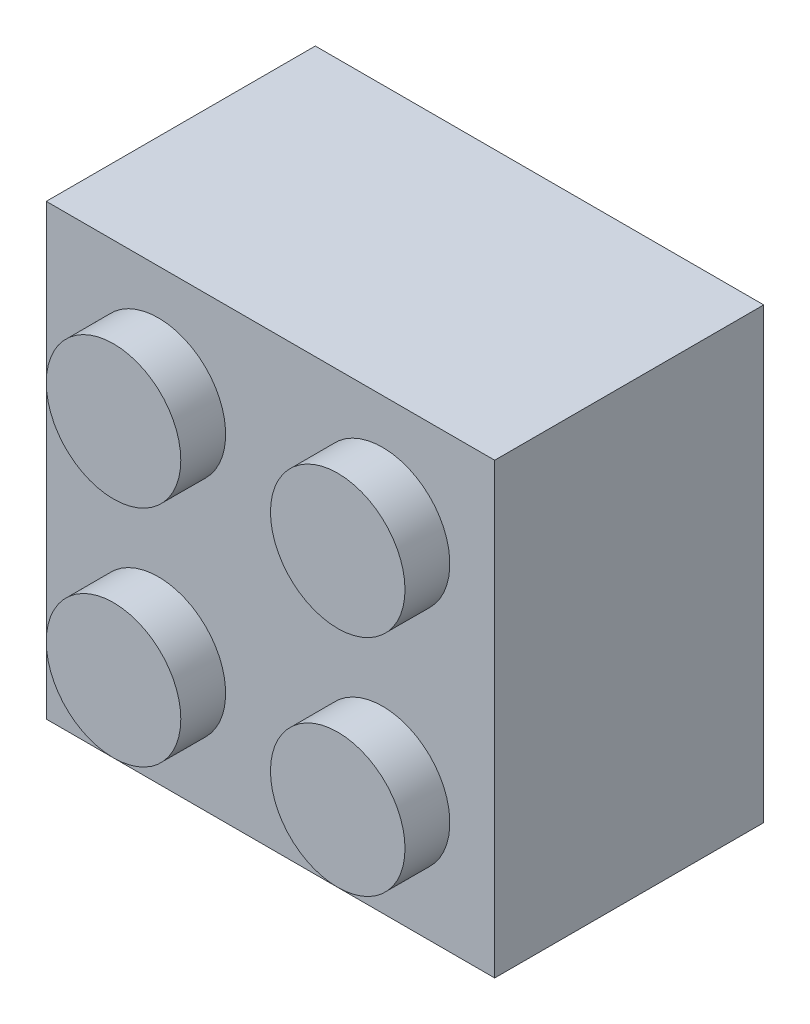
ISO-10303-21;
HEADER;
FILE_DESCRIPTION(('STEP AP214'),'2;1');
FILE_NAME('part.step','',(''),(''),'','','');
FILE_SCHEMA(('AUTOMOTIVE_DESIGN { 1 0 10303 214 1 1 1 1 }'));
ENDSEC;
DATA;
#1=APPLICATION_CONTEXT('core data for automotive mechanical design processes');
#2=APPLICATION_PROTOCOL_DEFINITION('international standard','automotive_design',2000,#1);
#3=PRODUCT_CONTEXT('',#1,'mechanical');
#4=PRODUCT('Part','Part','',(#3));
#5=PRODUCT_RELATED_PRODUCT_CATEGORY('part','',(#4));
#6=PRODUCT_DEFINITION_FORMATION('','',#4);
#7=PRODUCT_DEFINITION_CONTEXT('part definition',#1,'design');
#8=PRODUCT_DEFINITION('design','',#6,#7);
#9=PRODUCT_DEFINITION_SHAPE('','',#8);
#10=(LENGTH_UNIT() NAMED_UNIT(*) SI_UNIT(.MILLI.,.METRE.));
#11=(NAMED_UNIT(*) PLANE_ANGLE_UNIT() SI_UNIT($,.RADIAN.));
#12=(NAMED_UNIT(*) SI_UNIT($,.STERADIAN.) SOLID_ANGLE_UNIT());
#13=UNCERTAINTY_MEASURE_WITH_UNIT(LENGTH_MEASURE(1.E-05),#10,'distance_accuracy_value','');
#14=(GEOMETRIC_REPRESENTATION_CONTEXT(3) GLOBAL_UNCERTAINTY_ASSIGNED_CONTEXT((#13)) GLOBAL_UNIT_ASSIGNED_CONTEXT((#10,
#11,#12)) REPRESENTATION_CONTEXT('',''));
#15=CARTESIAN_POINT('',(0.,0.,0.));
#16=DIRECTION('',(0.,0.,1.));
#17=DIRECTION('',(1.,0.,0.));
#18=AXIS2_PLACEMENT_3D('',#15,#16,#17);
#19=CARTESIAN_POINT('',(0.,0.,7.9375));
#20=DIRECTION('',(0.,0.,-1.));
#21=DIRECTION('',(-1.,0.,0.));
#22=AXIS2_PLACEMENT_3D('',#19,#20,#21);
#23=PLANE('',#22);
#24=CARTESIAN_POINT('',(3.96875,11.90625,7.9375));
#25=DIRECTION('',(0.,0.,-1.));
#26=DIRECTION('',(-1.,0.,0.));
#27=AXIS2_PLACEMENT_3D('',#24,#25,#26);
#28=CIRCLE('',#27,0.79375);
#29=CARTESIAN_POINT('',(3.175,11.90625,7.9375));
#30=VERTEX_POINT('',#29);
#31=EDGE_CURVE('E139',#30,#30,#28,.F.);
#32=ORIENTED_EDGE('',*,*,#31,.T.);
#33=EDGE_LOOP('',(#32));
#34=FACE_BOUND('',#33,.T.);
#35=DIRECTION('',(0.,-1.,0.));
#36=VECTOR('',#35,1.);
#37=CARTESIAN_POINT('',(1.5875,0.,7.9375));
#38=LINE('',#37,#36);
#39=CARTESIAN_POINT('',(1.5875,14.2875,7.9375));
#40=VERTEX_POINT('',#39);
#41=CARTESIAN_POINT('',(1.5875,1.5875,7.9375));
#42=VERTEX_POINT('',#41);
#43=EDGE_CURVE('E121',#40,#42,#38,.T.);
#44=ORIENTED_EDGE('',*,*,#43,.F.);
#45=DIRECTION('',(-1.,0.,0.));
#46=VECTOR('',#45,1.);
#47=CARTESIAN_POINT('',(0.,14.2875,7.9375));
#48=LINE('',#47,#46);
#49=CARTESIAN_POINT('',(14.2875,14.2875,7.9375));
#50=VERTEX_POINT('',#49);
#51=EDGE_CURVE('E129',#50,#40,#48,.T.);
#52=ORIENTED_EDGE('',*,*,#51,.F.);
#53=DIRECTION('',(0.,1.,0.));
#54=VECTOR('',#53,1.);
#55=CARTESIAN_POINT('',(14.2875,0.,7.9375));
#56=LINE('',#55,#54);
#57=CARTESIAN_POINT('',(14.2875,1.5875,7.9375));
#58=VERTEX_POINT('',#57);
#59=EDGE_CURVE('E120',#58,#50,#56,.T.);
#60=ORIENTED_EDGE('',*,*,#59,.F.);
#61=DIRECTION('',(1.,0.,0.));
#62=VECTOR('',#61,1.);
#63=CARTESIAN_POINT('',(0.,1.5875,7.9375));
#64=LINE('',#63,#62);
#65=EDGE_CURVE('E110',#42,#58,#64,.T.);
#66=ORIENTED_EDGE('',*,*,#65,.F.);
#67=EDGE_LOOP('',(#44,#52,#60,#66));
#68=FACE_BOUND('',#67,.T.);
#69=CARTESIAN_POINT('',(3.96875,3.96875,7.9375));
#70=DIRECTION('',(0.,0.,-1.));
#71=DIRECTION('',(-1.,0.,0.));
#72=AXIS2_PLACEMENT_3D('',#69,#70,#71);
#73=CIRCLE('',#72,0.79375);
#74=CARTESIAN_POINT('',(3.175,3.96875,7.9375));
#75=VERTEX_POINT('',#74);
#76=EDGE_CURVE('E135',#75,#75,#73,.F.);
#77=ORIENTED_EDGE('',*,*,#76,.T.);
#78=EDGE_LOOP('',(#77));
#79=FACE_BOUND('',#78,.T.);
#80=CARTESIAN_POINT('',(11.90625,11.90625,7.9375));
#81=DIRECTION('',(0.,0.,-1.));
#82=DIRECTION('',(-1.,0.,0.));
#83=AXIS2_PLACEMENT_3D('',#80,#81,#82);
#84=CIRCLE('',#83,0.79375);
#85=CARTESIAN_POINT('',(11.1125,11.90625,7.9375));
#86=VERTEX_POINT('',#85);
#87=EDGE_CURVE('E138',#86,#86,#84,.F.);
#88=ORIENTED_EDGE('',*,*,#87,.T.);
#89=EDGE_LOOP('',(#88));
#90=FACE_BOUND('',#89,.T.);
#91=CARTESIAN_POINT('',(11.90625,3.96875,7.9375));
#92=DIRECTION('',(0.,0.,-1.));
#93=DIRECTION('',(-1.,0.,0.));
#94=AXIS2_PLACEMENT_3D('',#91,#92,#93);
#95=CIRCLE('',#94,0.79375);
#96=CARTESIAN_POINT('',(11.1125,3.96875,7.9375));
#97=VERTEX_POINT('',#96);
#98=EDGE_CURVE('E143',#97,#97,#95,.F.);
#99=ORIENTED_EDGE('',*,*,#98,.T.);
#100=EDGE_LOOP('',(#99));
#101=FACE_BOUND('',#100,.T.);
#102=CARTESIAN_POINT('',(7.9375,7.9375,7.9375));
#103=DIRECTION('',(0.,0.,-1.));
#104=DIRECTION('',(-1.,0.,0.));
#105=AXIS2_PLACEMENT_3D('',#102,#103,#104);
#106=CIRCLE('',#105,3.175);
#107=CARTESIAN_POINT('',(4.7625,7.9375,7.9375));
#108=VERTEX_POINT('',#107);
#109=EDGE_CURVE('E281',#108,#108,#106,.T.);
#110=ORIENTED_EDGE('',*,*,#109,.F.);
#111=EDGE_LOOP('',(#110));
#112=FACE_BOUND('',#111,.T.);
#113=ADVANCED_FACE('F35',(#34,#68,#79,#90,#101,#112),#23,.T.);
#114=CARTESIAN_POINT('',(0.,0.,0.));
#115=DIRECTION('',(0.,0.,-1.));
#116=DIRECTION('',(-1.,0.,0.));
#117=AXIS2_PLACEMENT_3D('',#114,#115,#116);
#118=PLANE('',#117);
#119=DIRECTION('',(0.,-1.,0.));
#120=VECTOR('',#119,1.);
#121=CARTESIAN_POINT('',(0.,0.,0.));
#122=LINE('',#121,#120);
#123=CARTESIAN_POINT('',(0.,15.875,0.));
#124=VERTEX_POINT('',#123);
#125=CARTESIAN_POINT('',(0.,0.,0.));
#126=VERTEX_POINT('',#125);
#127=EDGE_CURVE('E176',#124,#126,#122,.T.);
#128=ORIENTED_EDGE('',*,*,#127,.F.);
#129=DIRECTION('',(-1.,0.,0.));
#130=VECTOR('',#129,1.);
#131=CARTESIAN_POINT('',(0.,15.875,0.));
#132=LINE('',#131,#130);
#133=CARTESIAN_POINT('',(15.875,15.875,0.));
#134=VERTEX_POINT('',#133);
#135=EDGE_CURVE('E80',#134,#124,#132,.T.);
#136=ORIENTED_EDGE('',*,*,#135,.F.);
#137=DIRECTION('',(0.,1.,0.));
#138=VECTOR('',#137,1.);
#139=CARTESIAN_POINT('',(15.875,0.,0.));
#140=LINE('',#139,#138);
#141=CARTESIAN_POINT('',(15.875,0.,0.));
#142=VERTEX_POINT('',#141);
#143=EDGE_CURVE('E188',#142,#134,#140,.T.);
#144=ORIENTED_EDGE('',*,*,#143,.F.);
#145=DIRECTION('',(1.,0.,0.));
#146=VECTOR('',#145,1.);
#147=CARTESIAN_POINT('',(0.,0.,0.));
#148=LINE('',#147,#146);
#149=EDGE_CURVE('E186',#126,#142,#148,.T.);
#150=ORIENTED_EDGE('',*,*,#149,.F.);
#151=EDGE_LOOP('',(#128,#136,#144,#150));
#152=FACE_BOUND('',#151,.T.);
#153=DIRECTION('',(-1.,0.,0.));
#154=VECTOR('',#153,1.);
#155=CARTESIAN_POINT('',(0.,14.2875,0.));
#156=LINE('',#155,#154);
#157=CARTESIAN_POINT('',(14.2875,14.2875,0.));
#158=VERTEX_POINT('',#157);
#159=CARTESIAN_POINT('',(1.5875,14.2875,0.));
#160=VERTEX_POINT('',#159);
#161=EDGE_CURVE('E166',#158,#160,#156,.T.);
#162=ORIENTED_EDGE('',*,*,#161,.T.);
#163=DIRECTION('',(0.,-1.,0.));
#164=VECTOR('',#163,1.);
#165=CARTESIAN_POINT('',(1.5875,0.,0.));
#166=LINE('',#165,#164);
#167=CARTESIAN_POINT('',(1.5875,1.5875,0.));
#168=VERTEX_POINT('',#167);
#169=EDGE_CURVE('E153',#160,#168,#166,.T.);
#170=ORIENTED_EDGE('',*,*,#169,.T.);
#171=DIRECTION('',(1.,0.,0.));
#172=VECTOR('',#171,1.);
#173=CARTESIAN_POINT('',(0.,1.5875,0.));
#174=LINE('',#173,#172);
#175=CARTESIAN_POINT('',(14.2875,1.5875,0.));
#176=VERTEX_POINT('',#175);
#177=EDGE_CURVE('E165',#168,#176,#174,.T.);
#178=ORIENTED_EDGE('',*,*,#177,.T.);
#179=DIRECTION('',(0.,1.,0.));
#180=VECTOR('',#179,1.);
#181=CARTESIAN_POINT('',(14.2875,0.,0.));
#182=LINE('',#181,#180);
#183=EDGE_CURVE('E50',#176,#158,#182,.T.);
#184=ORIENTED_EDGE('',*,*,#183,.T.);
#185=EDGE_LOOP('',(#162,#170,#178,#184));
#186=FACE_BOUND('',#185,.T.);
#187=ADVANCED_FACE('F226',(#152,#186),#118,.T.);
#188=CARTESIAN_POINT('',(0.,0.,9.525));
#189=DIRECTION('',(0.,0.,-1.));
#190=DIRECTION('',(-1.,0.,0.));
#191=AXIS2_PLACEMENT_3D('',#188,#189,#190);
#192=PLANE('',#191);
#193=CARTESIAN_POINT('',(3.96875,11.90625,9.525));
#194=DIRECTION('',(0.,0.,-1.));
#195=DIRECTION('',(-1.,0.,0.));
#196=AXIS2_PLACEMENT_3D('',#193,#194,#195);
#197=CIRCLE('',#196,2.38125);
#198=CARTESIAN_POINT('',(1.5875,11.90625,9.525));
#199=VERTEX_POINT('',#198);
#200=EDGE_CURVE('E199',#199,#199,#197,.F.);
#201=ORIENTED_EDGE('',*,*,#200,.F.);
#202=EDGE_LOOP('',(#201));
#203=FACE_BOUND('',#202,.T.);
#204=DIRECTION('',(0.,-1.,0.));
#205=VECTOR('',#204,1.);
#206=CARTESIAN_POINT('',(0.,0.,9.525));
#207=LINE('',#206,#205);
#208=CARTESIAN_POINT('',(0.,15.875,9.525));
#209=VERTEX_POINT('',#208);
#210=CARTESIAN_POINT('',(0.,0.,9.525));
#211=VERTEX_POINT('',#210);
#212=EDGE_CURVE('E177',#209,#211,#207,.T.);
#213=ORIENTED_EDGE('',*,*,#212,.T.);
#214=DIRECTION('',(1.,0.,0.));
#215=VECTOR('',#214,1.);
#216=CARTESIAN_POINT('',(0.,0.,9.525));
#217=LINE('',#216,#215);
#218=CARTESIAN_POINT('',(15.875,0.,9.525));
#219=VERTEX_POINT('',#218);
#220=EDGE_CURVE('E88',#211,#219,#217,.T.);
#221=ORIENTED_EDGE('',*,*,#220,.T.);
#222=DIRECTION('',(0.,1.,0.));
#223=VECTOR('',#222,1.);
#224=CARTESIAN_POINT('',(15.875,0.,9.525));
#225=LINE('',#224,#223);
#226=CARTESIAN_POINT('',(15.875,15.875,9.525));
#227=VERTEX_POINT('',#226);
#228=EDGE_CURVE('E180',#219,#227,#225,.T.);
#229=ORIENTED_EDGE('',*,*,#228,.T.);
#230=DIRECTION('',(-1.,0.,0.));
#231=VECTOR('',#230,1.);
#232=CARTESIAN_POINT('',(0.,15.875,9.525));
#233=LINE('',#232,#231);
#234=EDGE_CURVE('E59',#227,#209,#233,.T.);
#235=ORIENTED_EDGE('',*,*,#234,.T.);
#236=EDGE_LOOP('',(#213,#221,#229,#235));
#237=FACE_BOUND('',#236,.T.);
#238=CARTESIAN_POINT('',(3.96875,3.96875,9.525));
#239=DIRECTION('',(0.,0.,-1.));
#240=DIRECTION('',(-1.,0.,0.));
#241=AXIS2_PLACEMENT_3D('',#238,#239,#240);
#242=CIRCLE('',#241,2.38125);
#243=CARTESIAN_POINT('',(1.5875,3.96875,9.525));
#244=VERTEX_POINT('',#243);
#245=EDGE_CURVE('E202',#244,#244,#242,.F.);
#246=ORIENTED_EDGE('',*,*,#245,.F.);
#247=EDGE_LOOP('',(#246));
#248=FACE_BOUND('',#247,.T.);
#249=CARTESIAN_POINT('',(11.90625,11.90625,9.525));
#250=DIRECTION('',(0.,0.,-1.));
#251=DIRECTION('',(-1.,0.,0.));
#252=AXIS2_PLACEMENT_3D('',#249,#250,#251);
#253=CIRCLE('',#252,2.38125);
#254=CARTESIAN_POINT('',(9.525,11.90625,9.525));
#255=VERTEX_POINT('',#254);
#256=EDGE_CURVE('E205',#255,#255,#253,.F.);
#257=ORIENTED_EDGE('',*,*,#256,.F.);
#258=EDGE_LOOP('',(#257));
#259=FACE_BOUND('',#258,.T.);
#260=CARTESIAN_POINT('',(11.90625,3.96875,9.525));
#261=DIRECTION('',(0.,0.,-1.));
#262=DIRECTION('',(-1.,0.,0.));
#263=AXIS2_PLACEMENT_3D('',#260,#261,#262);
#264=CIRCLE('',#263,2.38125);
#265=CARTESIAN_POINT('',(9.525,3.96875,9.525));
#266=VERTEX_POINT('',#265);
#267=EDGE_CURVE('E211',#266,#266,#264,.F.);
#268=ORIENTED_EDGE('',*,*,#267,.F.);
#269=EDGE_LOOP('',(#268));
#270=FACE_BOUND('',#269,.T.);
#271=ADVANCED_FACE('F223',(#203,#237,#248,#259,#270),#192,.F.);
#272=CARTESIAN_POINT('',(0.,0.,9.525));
#273=DIRECTION('',(1.,0.,0.));
#274=DIRECTION('',(0.,0.,-1.));
#275=AXIS2_PLACEMENT_3D('',#272,#273,#274);
#276=PLANE('',#275);
#277=ORIENTED_EDGE('',*,*,#127,.T.);
#278=DIRECTION('',(0.,0.,-1.));
#279=VECTOR('',#278,1.);
#280=CARTESIAN_POINT('',(0.,0.,9.525));
#281=LINE('',#280,#279);
#282=EDGE_CURVE('E197',#211,#126,#281,.T.);
#283=ORIENTED_EDGE('',*,*,#282,.F.);
#284=ORIENTED_EDGE('',*,*,#212,.F.);
#285=DIRECTION('',(0.,0.,-1.));
#286=VECTOR('',#285,1.);
#287=CARTESIAN_POINT('',(0.,15.875,9.525));
#288=LINE('',#287,#286);
#289=EDGE_CURVE('E183',#209,#124,#288,.T.);
#290=ORIENTED_EDGE('',*,*,#289,.T.);
#291=EDGE_LOOP('',(#277,#283,#284,#290));
#292=FACE_BOUND('',#291,.T.);
#293=ADVANCED_FACE('F225',(#292),#276,.F.);
#294=CARTESIAN_POINT('',(0.,0.,9.525));
#295=DIRECTION('',(0.,1.,0.));
#296=DIRECTION('',(0.,0.,1.));
#297=AXIS2_PLACEMENT_3D('',#294,#295,#296);
#298=PLANE('',#297);
#299=ORIENTED_EDGE('',*,*,#149,.T.);
#300=DIRECTION('',(0.,0.,-1.));
#301=VECTOR('',#300,1.);
#302=CARTESIAN_POINT('',(15.875,0.,9.525));
#303=LINE('',#302,#301);
#304=EDGE_CURVE('E194',#219,#142,#303,.T.);
#305=ORIENTED_EDGE('',*,*,#304,.F.);
#306=ORIENTED_EDGE('',*,*,#220,.F.);
#307=ORIENTED_EDGE('',*,*,#282,.T.);
#308=EDGE_LOOP('',(#299,#305,#306,#307));
#309=FACE_BOUND('',#308,.T.);
#310=ADVANCED_FACE('F233',(#309),#298,.F.);
#311=CARTESIAN_POINT('',(15.875,0.,9.525));
#312=DIRECTION('',(-1.,0.,0.));
#313=DIRECTION('',(0.,0.,1.));
#314=AXIS2_PLACEMENT_3D('',#311,#312,#313);
#315=PLANE('',#314);
#316=ORIENTED_EDGE('',*,*,#143,.T.);
#317=DIRECTION('',(0.,0.,-1.));
#318=VECTOR('',#317,1.);
#319=CARTESIAN_POINT('',(15.875,15.875,9.525));
#320=LINE('',#319,#318);
#321=EDGE_CURVE('E192',#227,#134,#320,.T.);
#322=ORIENTED_EDGE('',*,*,#321,.F.);
#323=ORIENTED_EDGE('',*,*,#228,.F.);
#324=ORIENTED_EDGE('',*,*,#304,.T.);
#325=EDGE_LOOP('',(#316,#322,#323,#324));
#326=FACE_BOUND('',#325,.T.);
#327=ADVANCED_FACE('F348',(#326),#315,.F.);
#328=CARTESIAN_POINT('',(0.,15.875,9.525));
#329=DIRECTION('',(0.,-1.,0.));
#330=DIRECTION('',(0.,0.,-1.));
#331=AXIS2_PLACEMENT_3D('',#328,#329,#330);
#332=PLANE('',#331);
#333=ORIENTED_EDGE('',*,*,#135,.T.);
#334=ORIENTED_EDGE('',*,*,#289,.F.);
#335=ORIENTED_EDGE('',*,*,#234,.F.);
#336=ORIENTED_EDGE('',*,*,#321,.T.);
#337=EDGE_LOOP('',(#333,#334,#335,#336));
#338=FACE_BOUND('',#337,.T.);
#339=ADVANCED_FACE('F343',(#338),#332,.F.);
#340=CARTESIAN_POINT('',(3.96875,11.90625,11.1125));
#341=DIRECTION('',(0.,0.,-1.));
#342=DIRECTION('',(-1.,0.,0.));
#343=AXIS2_PLACEMENT_3D('',#340,#341,#342);
#344=CYLINDRICAL_SURFACE('',#343,2.38125);
#345=CARTESIAN_POINT('',(3.96875,11.90625,11.1125));
#346=DIRECTION('',(0.,0.,1.));
#347=DIRECTION('',(1.,0.,0.));
#348=AXIS2_PLACEMENT_3D('',#345,#346,#347);
#349=CIRCLE('',#348,2.38125);
#350=CARTESIAN_POINT('',(6.35,11.90625,11.1125));
#351=VERTEX_POINT('',#350);
#352=EDGE_CURVE('E173',#351,#351,#349,.T.);
#353=ORIENTED_EDGE('',*,*,#352,.F.);
#354=EDGE_LOOP('',(#353));
#355=FACE_BOUND('',#354,.T.);
#356=ORIENTED_EDGE('',*,*,#200,.T.);
#357=EDGE_LOOP('',(#356));
#358=FACE_BOUND('',#357,.T.);
#359=ADVANCED_FACE('F340',(#355,#358),#344,.T.);
#360=CARTESIAN_POINT('',(3.96875,11.90625,11.1125));
#361=DIRECTION('',(0.,0.,1.));
#362=DIRECTION('',(1.,0.,0.));
#363=AXIS2_PLACEMENT_3D('',#360,#361,#362);
#364=PLANE('',#363);
#365=ORIENTED_EDGE('',*,*,#352,.T.);
#366=EDGE_LOOP('',(#365));
#367=FACE_BOUND('',#366,.T.);
#368=ADVANCED_FACE('F337',(#367),#364,.T.);
#369=CARTESIAN_POINT('',(3.96875,3.96875,11.1125));
#370=DIRECTION('',(0.,0.,-1.));
#371=DIRECTION('',(-1.,0.,0.));
#372=AXIS2_PLACEMENT_3D('',#369,#370,#371);
#373=CYLINDRICAL_SURFACE('',#372,2.38125);
#374=CARTESIAN_POINT('',(3.96875,3.96875,11.1125));
#375=DIRECTION('',(0.,0.,1.));
#376=DIRECTION('',(1.,0.,0.));
#377=AXIS2_PLACEMENT_3D('',#374,#375,#376);
#378=CIRCLE('',#377,2.38125);
#379=CARTESIAN_POINT('',(6.35,3.96875,11.1125));
#380=VERTEX_POINT('',#379);
#381=EDGE_CURVE('E162',#380,#380,#378,.T.);
#382=ORIENTED_EDGE('',*,*,#381,.F.);
#383=EDGE_LOOP('',(#382));
#384=FACE_BOUND('',#383,.T.);
#385=ORIENTED_EDGE('',*,*,#245,.T.);
#386=EDGE_LOOP('',(#385));
#387=FACE_BOUND('',#386,.T.);
#388=ADVANCED_FACE('F333',(#384,#387),#373,.T.);
#389=CARTESIAN_POINT('',(3.96875,3.96875,11.1125));
#390=DIRECTION('',(0.,0.,1.));
#391=DIRECTION('',(1.,0.,0.));
#392=AXIS2_PLACEMENT_3D('',#389,#390,#391);
#393=PLANE('',#392);
#394=ORIENTED_EDGE('',*,*,#381,.T.);
#395=EDGE_LOOP('',(#394));
#396=FACE_BOUND('',#395,.T.);
#397=ADVANCED_FACE('F329',(#396),#393,.T.);
#398=CARTESIAN_POINT('',(11.90625,11.90625,11.1125));
#399=DIRECTION('',(0.,0.,1.));
#400=DIRECTION('',(1.,0.,0.));
#401=AXIS2_PLACEMENT_3D('',#398,#399,#400);
#402=PLANE('',#401);
#403=CARTESIAN_POINT('',(11.90625,11.90625,11.1125));
#404=DIRECTION('',(0.,0.,1.));
#405=DIRECTION('',(1.,0.,0.));
#406=AXIS2_PLACEMENT_3D('',#403,#404,#405);
#407=CIRCLE('',#406,2.38125);
#408=CARTESIAN_POINT('',(14.2875,11.90625,11.1125));
#409=VERTEX_POINT('',#408);
#410=EDGE_CURVE('E208',#409,#409,#407,.T.);
#411=ORIENTED_EDGE('',*,*,#410,.T.);
#412=EDGE_LOOP('',(#411));
#413=FACE_BOUND('',#412,.T.);
#414=ADVANCED_FACE('F332',(#413),#402,.T.);
#415=CARTESIAN_POINT('',(11.90625,11.90625,11.1125));
#416=DIRECTION('',(0.,0.,-1.));
#417=DIRECTION('',(-1.,0.,0.));
#418=AXIS2_PLACEMENT_3D('',#415,#416,#417);
#419=CYLINDRICAL_SURFACE('',#418,2.38125);
#420=ORIENTED_EDGE('',*,*,#410,.F.);
#421=EDGE_LOOP('',(#420));
#422=FACE_BOUND('',#421,.T.);
#423=ORIENTED_EDGE('',*,*,#256,.T.);
#424=EDGE_LOOP('',(#423));
#425=FACE_BOUND('',#424,.T.);
#426=ADVANCED_FACE('F360',(#422,#425),#419,.T.);
#427=CARTESIAN_POINT('',(11.90625,3.96875,11.1125));
#428=DIRECTION('',(0.,0.,1.));
#429=DIRECTION('',(1.,0.,0.));
#430=AXIS2_PLACEMENT_3D('',#427,#428,#429);
#431=PLANE('',#430);
#432=CARTESIAN_POINT('',(11.90625,3.96875,11.1125));
#433=DIRECTION('',(0.,0.,1.));
#434=DIRECTION('',(1.,0.,0.));
#435=AXIS2_PLACEMENT_3D('',#432,#433,#434);
#436=CIRCLE('',#435,2.38125);
#437=CARTESIAN_POINT('',(14.2875,3.96875,11.1125));
#438=VERTEX_POINT('',#437);
#439=EDGE_CURVE('E43',#438,#438,#436,.T.);
#440=ORIENTED_EDGE('',*,*,#439,.T.);
#441=EDGE_LOOP('',(#440));
#442=FACE_BOUND('',#441,.T.);
#443=ADVANCED_FACE('F37',(#442),#431,.T.);
#444=CARTESIAN_POINT('',(11.90625,3.96875,11.1125));
#445=DIRECTION('',(0.,0.,-1.));
#446=DIRECTION('',(-1.,0.,0.));
#447=AXIS2_PLACEMENT_3D('',#444,#445,#446);
#448=CYLINDRICAL_SURFACE('',#447,2.38125);
#449=ORIENTED_EDGE('',*,*,#439,.F.);
#450=EDGE_LOOP('',(#449));
#451=FACE_BOUND('',#450,.T.);
#452=ORIENTED_EDGE('',*,*,#267,.T.);
#453=EDGE_LOOP('',(#452));
#454=FACE_BOUND('',#453,.T.);
#455=ADVANCED_FACE('F217',(#451,#454),#448,.T.);
#456=CARTESIAN_POINT('',(1.5875,0.,9.525));
#457=DIRECTION('',(1.,0.,0.));
#458=DIRECTION('',(0.,0.,-1.));
#459=AXIS2_PLACEMENT_3D('',#456,#457,#458);
#460=PLANE('',#459);
#461=ORIENTED_EDGE('',*,*,#169,.F.);
#462=DIRECTION('',(0.,0.,-1.));
#463=VECTOR('',#462,1.);
#464=CARTESIAN_POINT('',(1.5875,14.2875,9.525));
#465=LINE('',#464,#463);
#466=EDGE_CURVE('E131',#40,#160,#465,.T.);
#467=ORIENTED_EDGE('',*,*,#466,.F.);
#468=ORIENTED_EDGE('',*,*,#43,.T.);
#469=DIRECTION('',(0.,0.,-1.));
#470=VECTOR('',#469,1.);
#471=CARTESIAN_POINT('',(1.5875,1.5875,9.525));
#472=LINE('',#471,#470);
#473=EDGE_CURVE('E115',#42,#168,#472,.T.);
#474=ORIENTED_EDGE('',*,*,#473,.T.);
#475=EDGE_LOOP('',(#461,#467,#468,#474));
#476=FACE_BOUND('',#475,.T.);
#477=ADVANCED_FACE('F220',(#476),#460,.T.);
#478=CARTESIAN_POINT('',(0.,1.5875,9.525));
#479=DIRECTION('',(0.,1.,0.));
#480=DIRECTION('',(0.,0.,1.));
#481=AXIS2_PLACEMENT_3D('',#478,#479,#480);
#482=PLANE('',#481);
#483=ORIENTED_EDGE('',*,*,#177,.F.);
#484=ORIENTED_EDGE('',*,*,#473,.F.);
#485=ORIENTED_EDGE('',*,*,#65,.T.);
#486=DIRECTION('',(0.,0.,-1.));
#487=VECTOR('',#486,1.);
#488=CARTESIAN_POINT('',(14.2875,1.5875,9.525));
#489=LINE('',#488,#487);
#490=EDGE_CURVE('E112',#58,#176,#489,.T.);
#491=ORIENTED_EDGE('',*,*,#490,.T.);
#492=EDGE_LOOP('',(#483,#484,#485,#491));
#493=FACE_BOUND('',#492,.T.);
#494=ADVANCED_FACE('F111',(#493),#482,.T.);
#495=CARTESIAN_POINT('',(14.2875,0.,9.525));
#496=DIRECTION('',(-1.,0.,0.));
#497=DIRECTION('',(0.,0.,1.));
#498=AXIS2_PLACEMENT_3D('',#495,#496,#497);
#499=PLANE('',#498);
#500=ORIENTED_EDGE('',*,*,#183,.F.);
#501=ORIENTED_EDGE('',*,*,#490,.F.);
#502=ORIENTED_EDGE('',*,*,#59,.T.);
#503=DIRECTION('',(0.,0.,-1.));
#504=VECTOR('',#503,1.);
#505=CARTESIAN_POINT('',(14.2875,14.2875,9.525));
#506=LINE('',#505,#504);
#507=EDGE_CURVE('E125',#50,#158,#506,.T.);
#508=ORIENTED_EDGE('',*,*,#507,.T.);
#509=EDGE_LOOP('',(#500,#501,#502,#508));
#510=FACE_BOUND('',#509,.T.);
#511=ADVANCED_FACE('F123',(#510),#499,.T.);
#512=CARTESIAN_POINT('',(0.,14.2875,9.525));
#513=DIRECTION('',(0.,-1.,0.));
#514=DIRECTION('',(0.,0.,-1.));
#515=AXIS2_PLACEMENT_3D('',#512,#513,#514);
#516=PLANE('',#515);
#517=ORIENTED_EDGE('',*,*,#161,.F.);
#518=ORIENTED_EDGE('',*,*,#507,.F.);
#519=ORIENTED_EDGE('',*,*,#51,.T.);
#520=ORIENTED_EDGE('',*,*,#466,.T.);
#521=EDGE_LOOP('',(#517,#518,#519,#520));
#522=FACE_BOUND('',#521,.T.);
#523=ADVANCED_FACE('F292',(#522),#516,.T.);
#524=CARTESIAN_POINT('',(3.96875,11.90625,11.1125));
#525=DIRECTION('',(0.,0.,-1.));
#526=DIRECTION('',(-1.,0.,0.));
#527=AXIS2_PLACEMENT_3D('',#524,#525,#526);
#528=CYLINDRICAL_SURFACE('',#527,0.79375);
#529=CARTESIAN_POINT('',(3.96875,11.90625,9.525));
#530=DIRECTION('',(0.,0.,1.));
#531=DIRECTION('',(1.,0.,0.));
#532=AXIS2_PLACEMENT_3D('',#529,#530,#531);
#533=CIRCLE('',#532,0.79375);
#534=CARTESIAN_POINT('',(4.7625,11.90625,9.525));
#535=VERTEX_POINT('',#534);
#536=EDGE_CURVE('E150',#535,#535,#533,.T.);
#537=ORIENTED_EDGE('',*,*,#536,.T.);
#538=EDGE_LOOP('',(#537));
#539=FACE_BOUND('',#538,.T.);
#540=ORIENTED_EDGE('',*,*,#31,.F.);
#541=EDGE_LOOP('',(#540));
#542=FACE_BOUND('',#541,.T.);
#543=ADVANCED_FACE('F295',(#539,#542),#528,.F.);
#544=CARTESIAN_POINT('',(3.96875,11.90625,9.525));
#545=DIRECTION('',(0.,0.,1.));
#546=DIRECTION('',(1.,0.,0.));
#547=AXIS2_PLACEMENT_3D('',#544,#545,#546);
#548=PLANE('',#547);
#549=ORIENTED_EDGE('',*,*,#536,.F.);
#550=EDGE_LOOP('',(#549));
#551=FACE_BOUND('',#550,.T.);
#552=ADVANCED_FACE('F301',(#551),#548,.F.);
#553=CARTESIAN_POINT('',(3.96875,3.96875,11.1125));
#554=DIRECTION('',(0.,0.,-1.));
#555=DIRECTION('',(-1.,0.,0.));
#556=AXIS2_PLACEMENT_3D('',#553,#554,#555);
#557=CYLINDRICAL_SURFACE('',#556,0.79375);
#558=CARTESIAN_POINT('',(3.96875,3.96875,9.525));
#559=DIRECTION('',(0.,0.,1.));
#560=DIRECTION('',(1.,0.,0.));
#561=AXIS2_PLACEMENT_3D('',#558,#559,#560);
#562=CIRCLE('',#561,0.79375);
#563=CARTESIAN_POINT('',(4.7625,3.96875,9.525));
#564=VERTEX_POINT('',#563);
#565=EDGE_CURVE('E154',#564,#564,#562,.T.);
#566=ORIENTED_EDGE('',*,*,#565,.T.);
#567=EDGE_LOOP('',(#566));
#568=FACE_BOUND('',#567,.T.);
#569=ORIENTED_EDGE('',*,*,#76,.F.);
#570=EDGE_LOOP('',(#569));
#571=FACE_BOUND('',#570,.T.);
#572=ADVANCED_FACE('F309',(#568,#571),#557,.F.);
#573=CARTESIAN_POINT('',(3.96875,3.96875,9.525));
#574=DIRECTION('',(0.,0.,1.));
#575=DIRECTION('',(1.,0.,0.));
#576=AXIS2_PLACEMENT_3D('',#573,#574,#575);
#577=PLANE('',#576);
#578=ORIENTED_EDGE('',*,*,#565,.F.);
#579=EDGE_LOOP('',(#578));
#580=FACE_BOUND('',#579,.T.);
#581=ADVANCED_FACE('F313',(#580),#577,.F.);
#582=CARTESIAN_POINT('',(11.90625,11.90625,9.525));
#583=DIRECTION('',(0.,0.,1.));
#584=DIRECTION('',(1.,0.,0.));
#585=AXIS2_PLACEMENT_3D('',#582,#583,#584);
#586=PLANE('',#585);
#587=CARTESIAN_POINT('',(11.90625,11.90625,9.525));
#588=DIRECTION('',(0.,0.,1.));
#589=DIRECTION('',(1.,0.,0.));
#590=AXIS2_PLACEMENT_3D('',#587,#588,#589);
#591=CIRCLE('',#590,0.79375);
#592=CARTESIAN_POINT('',(12.7,11.90625,9.525));
#593=VERTEX_POINT('',#592);
#594=EDGE_CURVE('E142',#593,#593,#591,.T.);
#595=ORIENTED_EDGE('',*,*,#594,.F.);
#596=EDGE_LOOP('',(#595));
#597=FACE_BOUND('',#596,.T.);
#598=ADVANCED_FACE('F317',(#597),#586,.F.);
#599=CARTESIAN_POINT('',(11.90625,11.90625,11.1125));
#600=DIRECTION('',(0.,0.,-1.));
#601=DIRECTION('',(-1.,0.,0.));
#602=AXIS2_PLACEMENT_3D('',#599,#600,#601);
#603=CYLINDRICAL_SURFACE('',#602,0.79375);
#604=ORIENTED_EDGE('',*,*,#594,.T.);
#605=EDGE_LOOP('',(#604));
#606=FACE_BOUND('',#605,.T.);
#607=ORIENTED_EDGE('',*,*,#87,.F.);
#608=EDGE_LOOP('',(#607));
#609=FACE_BOUND('',#608,.T.);
#610=ADVANCED_FACE('F321',(#606,#609),#603,.F.);
#611=CARTESIAN_POINT('',(11.90625,3.96875,9.525));
#612=DIRECTION('',(0.,0.,1.));
#613=DIRECTION('',(1.,0.,0.));
#614=AXIS2_PLACEMENT_3D('',#611,#612,#613);
#615=PLANE('',#614);
#616=CARTESIAN_POINT('',(11.90625,3.96875,9.525));
#617=DIRECTION('',(0.,0.,1.));
#618=DIRECTION('',(1.,0.,0.));
#619=AXIS2_PLACEMENT_3D('',#616,#617,#618);
#620=CIRCLE('',#619,0.79375);
#621=CARTESIAN_POINT('',(12.7,3.96875,9.525));
#622=VERTEX_POINT('',#621);
#623=EDGE_CURVE('E146',#622,#622,#620,.T.);
#624=ORIENTED_EDGE('',*,*,#623,.F.);
#625=EDGE_LOOP('',(#624));
#626=FACE_BOUND('',#625,.T.);
#627=ADVANCED_FACE('F273',(#626),#615,.F.);
#628=CARTESIAN_POINT('',(11.90625,3.96875,11.1125));
#629=DIRECTION('',(0.,0.,-1.));
#630=DIRECTION('',(-1.,0.,0.));
#631=AXIS2_PLACEMENT_3D('',#628,#629,#630);
#632=CYLINDRICAL_SURFACE('',#631,0.79375);
#633=ORIENTED_EDGE('',*,*,#623,.T.);
#634=EDGE_LOOP('',(#633));
#635=FACE_BOUND('',#634,.T.);
#636=ORIENTED_EDGE('',*,*,#98,.F.);
#637=EDGE_LOOP('',(#636));
#638=FACE_BOUND('',#637,.T.);
#639=ADVANCED_FACE('F268',(#635,#638),#632,.F.);
#640=CARTESIAN_POINT('',(7.9375,7.9375,0.));
#641=DIRECTION('',(0.,0.,-1.));
#642=DIRECTION('',(-1.,0.,0.));
#643=AXIS2_PLACEMENT_3D('',#640,#641,#642);
#644=PLANE('',#643);
#645=CARTESIAN_POINT('',(7.9375,7.9375,0.));
#646=DIRECTION('',(0.,0.,-1.));
#647=DIRECTION('',(-1.,0.,0.));
#648=AXIS2_PLACEMENT_3D('',#645,#646,#647);
#649=CIRCLE('',#648,3.175);
#650=CARTESIAN_POINT('',(4.7625,7.9375,0.));
#651=VERTEX_POINT('',#650);
#652=EDGE_CURVE('E157',#651,#651,#649,.T.);
#653=ORIENTED_EDGE('',*,*,#652,.T.);
#654=EDGE_LOOP('',(#653));
#655=FACE_BOUND('',#654,.T.);
#656=CARTESIAN_POINT('',(7.9375,7.9375,0.));
#657=DIRECTION('',(0.,0.,-1.));
#658=DIRECTION('',(-1.,0.,0.));
#659=AXIS2_PLACEMENT_3D('',#656,#657,#658);
#660=CIRCLE('',#659,2.38125);
#661=CARTESIAN_POINT('',(5.55625,7.9375,0.));
#662=VERTEX_POINT('',#661);
#663=EDGE_CURVE('E280',#662,#662,#660,.T.);
#664=ORIENTED_EDGE('',*,*,#663,.F.);
#665=EDGE_LOOP('',(#664));
#666=FACE_BOUND('',#665,.T.);
#667=ADVANCED_FACE('F263',(#655,#666),#644,.T.);
#668=CARTESIAN_POINT('',(7.9375,7.9375,0.));
#669=DIRECTION('',(0.,0.,1.));
#670=DIRECTION('',(1.,0.,0.));
#671=AXIS2_PLACEMENT_3D('',#668,#669,#670);
#672=CYLINDRICAL_SURFACE('',#671,3.175);
#673=ORIENTED_EDGE('',*,*,#652,.F.);
#674=EDGE_LOOP('',(#673));
#675=FACE_BOUND('',#674,.T.);
#676=ORIENTED_EDGE('',*,*,#109,.T.);
#677=EDGE_LOOP('',(#676));
#678=FACE_BOUND('',#677,.T.);
#679=ADVANCED_FACE('F255',(#675,#678),#672,.T.);
#680=CARTESIAN_POINT('',(7.9375,7.9375,0.));
#681=DIRECTION('',(0.,0.,1.));
#682=DIRECTION('',(1.,0.,0.));
#683=AXIS2_PLACEMENT_3D('',#680,#681,#682);
#684=CYLINDRICAL_SURFACE('',#683,2.38125);
#685=ORIENTED_EDGE('',*,*,#663,.T.);
#686=EDGE_LOOP('',(#685));
#687=FACE_BOUND('',#686,.T.);
#688=CARTESIAN_POINT('',(7.9375,7.9375,7.9375));
#689=DIRECTION('',(0.,0.,-1.));
#690=DIRECTION('',(-1.,0.,0.));
#691=AXIS2_PLACEMENT_3D('',#688,#689,#690);
#692=CIRCLE('',#691,2.38125);
#693=CARTESIAN_POINT('',(5.55625,7.9375,7.9375));
#694=VERTEX_POINT('',#693);
#695=EDGE_CURVE('E11',#694,#694,#692,.F.);
#696=ORIENTED_EDGE('',*,*,#695,.T.);
#697=EDGE_LOOP('',(#696));
#698=FACE_BOUND('',#697,.T.);
#699=ADVANCED_FACE('F250',(#687,#698),#684,.F.);
#700=ORIENTED_EDGE('',*,*,#695,.F.);
#701=EDGE_LOOP('',(#700));
#702=FACE_BOUND('',#701,.T.);
#703=ADVANCED_FACE('F243',(#702),#23,.T.);
#704=CLOSED_SHELL('',(#113,#187,#271,#293,#310,#327,#339,#359,#368,#388,#397,#414,#426,#443,
#455,#477,#494,#511,#523,#543,#552,#572,#581,#598,#610,#627,#639,#667,#679,#699,#703));
#705=MANIFOLD_SOLID_BREP('B2',#704);
#706=ADVANCED_BREP_SHAPE_REPRESENTATION('',(#18,#705),#14);
#707=SHAPE_DEFINITION_REPRESENTATION(#9,#706);
ENDSEC;
END-ISO-10303-21;
